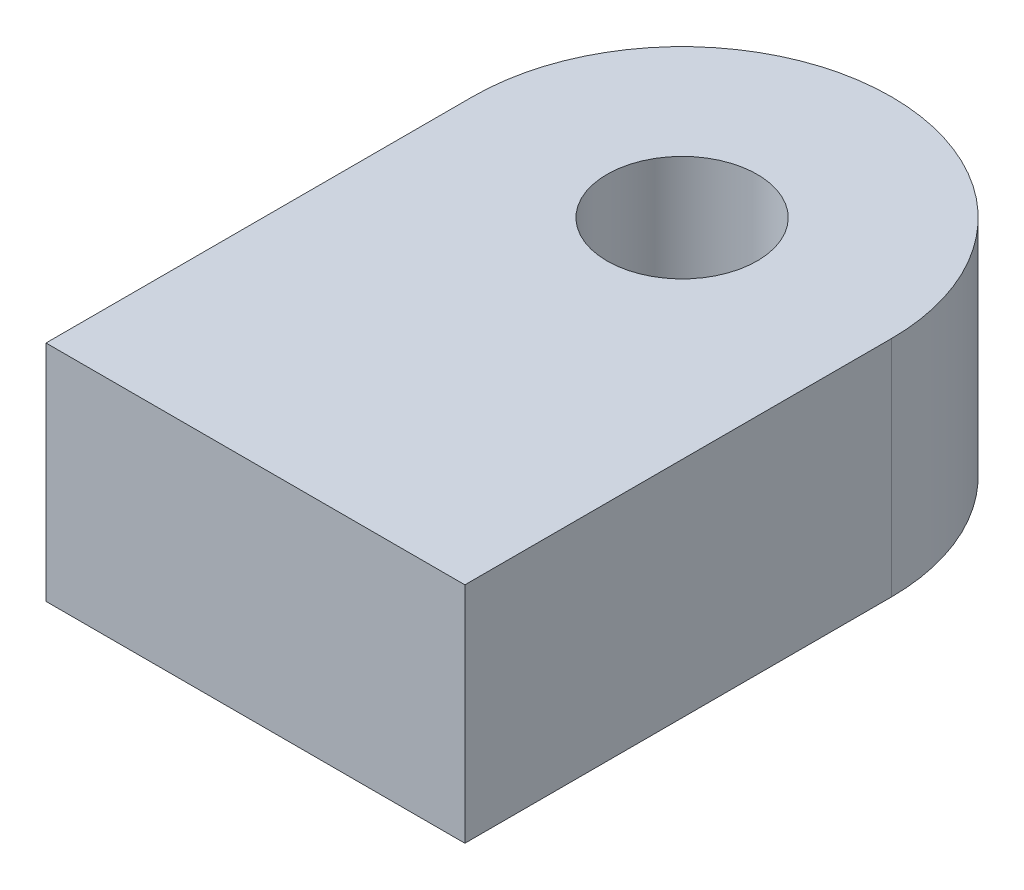
ISO-10303-21;
HEADER;
FILE_DESCRIPTION(('STEP AP214'),'2;1');
FILE_NAME('part.step','',(''),(''),'','','');
FILE_SCHEMA(('AUTOMOTIVE_DESIGN { 1 0 10303 214 1 1 1 1 }'));
ENDSEC;
DATA;
#1=APPLICATION_CONTEXT('core data for automotive mechanical design processes');
#2=APPLICATION_PROTOCOL_DEFINITION('international standard','automotive_design',2000,#1);
#3=PRODUCT_CONTEXT('',#1,'mechanical');
#4=PRODUCT('Part','Part','',(#3));
#5=PRODUCT_RELATED_PRODUCT_CATEGORY('part','',(#4));
#6=PRODUCT_DEFINITION_FORMATION('','',#4);
#7=PRODUCT_DEFINITION_CONTEXT('part definition',#1,'design');
#8=PRODUCT_DEFINITION('design','',#6,#7);
#9=PRODUCT_DEFINITION_SHAPE('','',#8);
#10=(LENGTH_UNIT() NAMED_UNIT(*) SI_UNIT(.MILLI.,.METRE.));
#11=(NAMED_UNIT(*) PLANE_ANGLE_UNIT() SI_UNIT($,.RADIAN.));
#12=(NAMED_UNIT(*) SI_UNIT($,.STERADIAN.) SOLID_ANGLE_UNIT());
#13=UNCERTAINTY_MEASURE_WITH_UNIT(LENGTH_MEASURE(1.E-05),#10,'distance_accuracy_value','');
#14=(GEOMETRIC_REPRESENTATION_CONTEXT(3) GLOBAL_UNCERTAINTY_ASSIGNED_CONTEXT((#13)) GLOBAL_UNIT_ASSIGNED_CONTEXT((#10,
#11,#12)) REPRESENTATION_CONTEXT('',''));
#15=CARTESIAN_POINT('',(0.,0.,0.));
#16=DIRECTION('',(0.,0.,1.));
#17=DIRECTION('',(1.,0.,0.));
#18=AXIS2_PLACEMENT_3D('',#15,#16,#17);
#19=CARTESIAN_POINT('',(15.52,16.59,-31.62));
#20=DIRECTION('',(0.,1.,0.));
#21=DIRECTION('',(0.,0.,1.));
#22=AXIS2_PLACEMENT_3D('',#19,#20,#21);
#23=PLANE('',#22);
#24=DIRECTION('',(0.,0.,1.));
#25=VECTOR('',#24,1.);
#26=CARTESIAN_POINT('',(0.,16.59,0.));
#27=LINE('',#26,#25);
#28=CARTESIAN_POINT('',(0.,16.59,-31.6199999999999));
#29=VERTEX_POINT('',#28);
#30=CARTESIAN_POINT('',(0.,16.59,0.));
#31=VERTEX_POINT('',#30);
#32=EDGE_CURVE('E129',#29,#31,#27,.T.);
#33=ORIENTED_EDGE('',*,*,#32,.T.);
#34=DIRECTION('',(1.,0.,0.));
#35=VECTOR('',#34,1.);
#36=CARTESIAN_POINT('',(0.,16.59,0.));
#37=LINE('',#36,#35);
#38=CARTESIAN_POINT('',(31.05,16.59,0.));
#39=VERTEX_POINT('',#38);
#40=EDGE_CURVE('E87',#31,#39,#37,.T.);
#41=ORIENTED_EDGE('',*,*,#40,.T.);
#42=DIRECTION('',(0.,0.,-1.));
#43=VECTOR('',#42,1.);
#44=CARTESIAN_POINT('',(31.05,16.59,0.));
#45=LINE('',#44,#43);
#46=CARTESIAN_POINT('',(31.05,16.59,-31.6199999999999));
#47=VERTEX_POINT('',#46);
#48=EDGE_CURVE('E100',#39,#47,#45,.T.);
#49=ORIENTED_EDGE('',*,*,#48,.T.);
#50=CARTESIAN_POINT('',(15.53,16.59,-31.62));
#51=DIRECTION('',(0.,1.,0.));
#52=DIRECTION('',(0.,0.,-1.));
#53=AXIS2_PLACEMENT_3D('',#50,#51,#52);
#54=CIRCLE('',#53,15.52);
#55=CARTESIAN_POINT('',(15.5299999999999,16.59,-47.14));
#56=VERTEX_POINT('',#55);
#57=EDGE_CURVE('E94',#47,#56,#54,.T.);
#58=ORIENTED_EDGE('',*,*,#57,.T.);
#59=DIRECTION('',(-1.,0.,0.));
#60=VECTOR('',#59,1.);
#61=CARTESIAN_POINT('',(15.5200000000001,16.59,-47.14));
#62=LINE('',#61,#60);
#63=CARTESIAN_POINT('',(15.5200000000001,16.59,-47.14));
#64=VERTEX_POINT('',#63);
#65=EDGE_CURVE('E98',#56,#64,#62,.T.);
#66=ORIENTED_EDGE('',*,*,#65,.T.);
#67=CARTESIAN_POINT('',(15.52,16.59,-31.62));
#68=DIRECTION('',(0.,1.,0.));
#69=DIRECTION('',(0.,0.,1.));
#70=AXIS2_PLACEMENT_3D('',#67,#68,#69);
#71=CIRCLE('',#70,15.52);
#72=EDGE_CURVE('E50',#64,#29,#71,.T.);
#73=ORIENTED_EDGE('',*,*,#72,.T.);
#74=EDGE_LOOP('',(#33,#41,#49,#58,#66,#73));
#75=FACE_BOUND('',#74,.T.);
#76=CARTESIAN_POINT('',(15.53,16.59,-31.62));
#77=DIRECTION('',(0.,1.,0.));
#78=DIRECTION('',(0.,0.,1.));
#79=AXIS2_PLACEMENT_3D('',#76,#77,#78);
#80=CIRCLE('',#79,5.565);
#81=CARTESIAN_POINT('',(15.53,16.59,-26.055));
#82=VERTEX_POINT('',#81);
#83=EDGE_CURVE('E122',#82,#82,#80,.T.);
#84=ORIENTED_EDGE('',*,*,#83,.F.);
#85=EDGE_LOOP('',(#84));
#86=FACE_BOUND('',#85,.T.);
#87=ADVANCED_FACE('F33',(#75,#86),#23,.T.);
#88=CARTESIAN_POINT('',(15.52,0.,-31.62));
#89=DIRECTION('',(0.,1.,0.));
#90=DIRECTION('',(0.,0.,1.));
#91=AXIS2_PLACEMENT_3D('',#88,#89,#90);
#92=PLANE('',#91);
#93=DIRECTION('',(0.,0.,1.));
#94=VECTOR('',#93,1.);
#95=CARTESIAN_POINT('',(0.,0.,0.));
#96=LINE('',#95,#94);
#97=CARTESIAN_POINT('',(0.,0.,-31.6199999999999));
#98=VERTEX_POINT('',#97);
#99=CARTESIAN_POINT('',(0.,0.,0.));
#100=VERTEX_POINT('',#99);
#101=EDGE_CURVE('E118',#98,#100,#96,.T.);
#102=ORIENTED_EDGE('',*,*,#101,.F.);
#103=CARTESIAN_POINT('',(15.52,0.,-31.62));
#104=DIRECTION('',(0.,1.,0.));
#105=DIRECTION('',(0.,0.,1.));
#106=AXIS2_PLACEMENT_3D('',#103,#104,#105);
#107=CIRCLE('',#106,15.52);
#108=CARTESIAN_POINT('',(15.5200000000001,0.,-47.14));
#109=VERTEX_POINT('',#108);
#110=EDGE_CURVE('E79',#109,#98,#107,.T.);
#111=ORIENTED_EDGE('',*,*,#110,.F.);
#112=DIRECTION('',(-1.,0.,0.));
#113=VECTOR('',#112,1.);
#114=CARTESIAN_POINT('',(15.5200000000001,0.,-47.14));
#115=LINE('',#114,#113);
#116=CARTESIAN_POINT('',(15.5299999999999,0.,-47.14));
#117=VERTEX_POINT('',#116);
#118=EDGE_CURVE('E73',#117,#109,#115,.T.);
#119=ORIENTED_EDGE('',*,*,#118,.F.);
#120=CARTESIAN_POINT('',(15.53,0.,-31.62));
#121=DIRECTION('',(0.,1.,0.));
#122=DIRECTION('',(0.,0.,-1.));
#123=AXIS2_PLACEMENT_3D('',#120,#121,#122);
#124=CIRCLE('',#123,15.52);
#125=CARTESIAN_POINT('',(31.05,0.,-31.6199999999999));
#126=VERTEX_POINT('',#125);
#127=EDGE_CURVE('E108',#126,#117,#124,.T.);
#128=ORIENTED_EDGE('',*,*,#127,.F.);
#129=DIRECTION('',(0.,0.,-1.));
#130=VECTOR('',#129,1.);
#131=CARTESIAN_POINT('',(31.05,0.,0.));
#132=LINE('',#131,#130);
#133=CARTESIAN_POINT('',(31.05,0.,0.));
#134=VERTEX_POINT('',#133);
#135=EDGE_CURVE('E124',#134,#126,#132,.T.);
#136=ORIENTED_EDGE('',*,*,#135,.F.);
#137=DIRECTION('',(1.,0.,0.));
#138=VECTOR('',#137,1.);
#139=CARTESIAN_POINT('',(0.,0.,0.));
#140=LINE('',#139,#138);
#141=EDGE_CURVE('E121',#100,#134,#140,.T.);
#142=ORIENTED_EDGE('',*,*,#141,.F.);
#143=EDGE_LOOP('',(#102,#111,#119,#128,#136,#142));
#144=FACE_BOUND('',#143,.T.);
#145=CARTESIAN_POINT('',(15.53,0.,-31.62));
#146=DIRECTION('',(0.,1.,0.));
#147=DIRECTION('',(0.,0.,1.));
#148=AXIS2_PLACEMENT_3D('',#145,#146,#147);
#149=CIRCLE('',#148,5.565);
#150=CARTESIAN_POINT('',(15.53,0.,-26.055));
#151=VERTEX_POINT('',#150);
#152=EDGE_CURVE('E222',#151,#151,#149,.T.);
#153=ORIENTED_EDGE('',*,*,#152,.T.);
#154=EDGE_LOOP('',(#153));
#155=FACE_BOUND('',#154,.T.);
#156=ADVANCED_FACE('F138',(#144,#155),#92,.F.);
#157=CARTESIAN_POINT('',(0.,16.59,0.));
#158=DIRECTION('',(1.,0.,0.));
#159=DIRECTION('',(0.,0.,-1.));
#160=AXIS2_PLACEMENT_3D('',#157,#158,#159);
#161=PLANE('',#160);
#162=ORIENTED_EDGE('',*,*,#101,.T.);
#163=DIRECTION('',(0.,-1.,0.));
#164=VECTOR('',#163,1.);
#165=CARTESIAN_POINT('',(0.,16.59,0.));
#166=LINE('',#165,#164);
#167=EDGE_CURVE('E11',#31,#100,#166,.T.);
#168=ORIENTED_EDGE('',*,*,#167,.F.);
#169=ORIENTED_EDGE('',*,*,#32,.F.);
#170=DIRECTION('',(0.,-1.,0.));
#171=VECTOR('',#170,1.);
#172=CARTESIAN_POINT('',(0.,16.59,-31.6199999999999));
#173=LINE('',#172,#171);
#174=EDGE_CURVE('E114',#29,#98,#173,.T.);
#175=ORIENTED_EDGE('',*,*,#174,.T.);
#176=EDGE_LOOP('',(#162,#168,#169,#175));
#177=FACE_BOUND('',#176,.T.);
#178=ADVANCED_FACE('F35',(#177),#161,.F.);
#179=CARTESIAN_POINT('',(0.,16.59,0.));
#180=DIRECTION('',(0.,0.,-1.));
#181=DIRECTION('',(-1.,0.,0.));
#182=AXIS2_PLACEMENT_3D('',#179,#180,#181);
#183=PLANE('',#182);
#184=ORIENTED_EDGE('',*,*,#141,.T.);
#185=DIRECTION('',(0.,-1.,0.));
#186=VECTOR('',#185,1.);
#187=CARTESIAN_POINT('',(31.05,16.59,0.));
#188=LINE('',#187,#186);
#189=EDGE_CURVE('E42',#39,#134,#188,.T.);
#190=ORIENTED_EDGE('',*,*,#189,.F.);
#191=ORIENTED_EDGE('',*,*,#40,.F.);
#192=ORIENTED_EDGE('',*,*,#167,.T.);
#193=EDGE_LOOP('',(#184,#190,#191,#192));
#194=FACE_BOUND('',#193,.T.);
#195=ADVANCED_FACE('F163',(#194),#183,.F.);
#196=CARTESIAN_POINT('',(31.05,16.59,0.));
#197=DIRECTION('',(-1.,0.,0.));
#198=DIRECTION('',(0.,0.,1.));
#199=AXIS2_PLACEMENT_3D('',#196,#197,#198);
#200=PLANE('',#199);
#201=ORIENTED_EDGE('',*,*,#135,.T.);
#202=DIRECTION('',(0.,-1.,0.));
#203=VECTOR('',#202,1.);
#204=CARTESIAN_POINT('',(31.05,16.59,-31.6199999999999));
#205=LINE('',#204,#203);
#206=EDGE_CURVE('E109',#47,#126,#205,.T.);
#207=ORIENTED_EDGE('',*,*,#206,.F.);
#208=ORIENTED_EDGE('',*,*,#48,.F.);
#209=ORIENTED_EDGE('',*,*,#189,.T.);
#210=EDGE_LOOP('',(#201,#207,#208,#209));
#211=FACE_BOUND('',#210,.T.);
#212=ADVANCED_FACE('F135',(#211),#200,.F.);
#213=CARTESIAN_POINT('',(15.53,16.59,-31.62));
#214=DIRECTION('',(0.,-1.,0.));
#215=DIRECTION('',(0.,0.,-1.));
#216=AXIS2_PLACEMENT_3D('',#213,#214,#215);
#217=CYLINDRICAL_SURFACE('',#216,15.52);
#218=ORIENTED_EDGE('',*,*,#127,.T.);
#219=DIRECTION('',(0.,-1.,0.));
#220=VECTOR('',#219,1.);
#221=CARTESIAN_POINT('',(15.5299999999999,16.59,-47.14));
#222=LINE('',#221,#220);
#223=EDGE_CURVE('E105',#56,#117,#222,.T.);
#224=ORIENTED_EDGE('',*,*,#223,.F.);
#225=ORIENTED_EDGE('',*,*,#57,.F.);
#226=ORIENTED_EDGE('',*,*,#206,.T.);
#227=EDGE_LOOP('',(#218,#224,#225,#226));
#228=FACE_BOUND('',#227,.T.);
#229=ADVANCED_FACE('F106',(#228),#217,.T.);
#230=CARTESIAN_POINT('',(15.5200000000001,16.59,-47.14));
#231=DIRECTION('',(0.,0.,1.));
#232=DIRECTION('',(1.,0.,0.));
#233=AXIS2_PLACEMENT_3D('',#230,#231,#232);
#234=PLANE('',#233);
#235=ORIENTED_EDGE('',*,*,#118,.T.);
#236=DIRECTION('',(0.,-1.,0.));
#237=VECTOR('',#236,1.);
#238=CARTESIAN_POINT('',(15.5200000000001,16.59,-47.14));
#239=LINE('',#238,#237);
#240=EDGE_CURVE('E110',#64,#109,#239,.T.);
#241=ORIENTED_EDGE('',*,*,#240,.F.);
#242=ORIENTED_EDGE('',*,*,#65,.F.);
#243=ORIENTED_EDGE('',*,*,#223,.T.);
#244=EDGE_LOOP('',(#235,#241,#242,#243));
#245=FACE_BOUND('',#244,.T.);
#246=ADVANCED_FACE('F112',(#245),#234,.F.);
#247=CARTESIAN_POINT('',(15.52,16.59,-31.62));
#248=DIRECTION('',(0.,-1.,0.));
#249=DIRECTION('',(0.,0.,-1.));
#250=AXIS2_PLACEMENT_3D('',#247,#248,#249);
#251=CYLINDRICAL_SURFACE('',#250,15.52);
#252=ORIENTED_EDGE('',*,*,#110,.T.);
#253=ORIENTED_EDGE('',*,*,#174,.F.);
#254=ORIENTED_EDGE('',*,*,#72,.F.);
#255=ORIENTED_EDGE('',*,*,#240,.T.);
#256=EDGE_LOOP('',(#252,#253,#254,#255));
#257=FACE_BOUND('',#256,.T.);
#258=ADVANCED_FACE('F143',(#257),#251,.T.);
#259=CARTESIAN_POINT('',(15.53,16.59,-31.62));
#260=DIRECTION('',(0.,-1.,0.));
#261=DIRECTION('',(0.,0.,-1.));
#262=AXIS2_PLACEMENT_3D('',#259,#260,#261);
#263=CYLINDRICAL_SURFACE('',#262,5.565);
#264=ORIENTED_EDGE('',*,*,#83,.T.);
#265=EDGE_LOOP('',(#264));
#266=FACE_BOUND('',#265,.T.);
#267=ORIENTED_EDGE('',*,*,#152,.F.);
#268=EDGE_LOOP('',(#267));
#269=FACE_BOUND('',#268,.T.);
#270=ADVANCED_FACE('F145',(#266,#269),#263,.F.);
#271=CLOSED_SHELL('',(#87,#156,#178,#195,#212,#229,#246,#258,#270));
#272=MANIFOLD_SOLID_BREP('B2',#271);
#273=ADVANCED_BREP_SHAPE_REPRESENTATION('',(#18,#272),#14);
#274=SHAPE_DEFINITION_REPRESENTATION(#9,#273);
ENDSEC;
END-ISO-10303-21;
